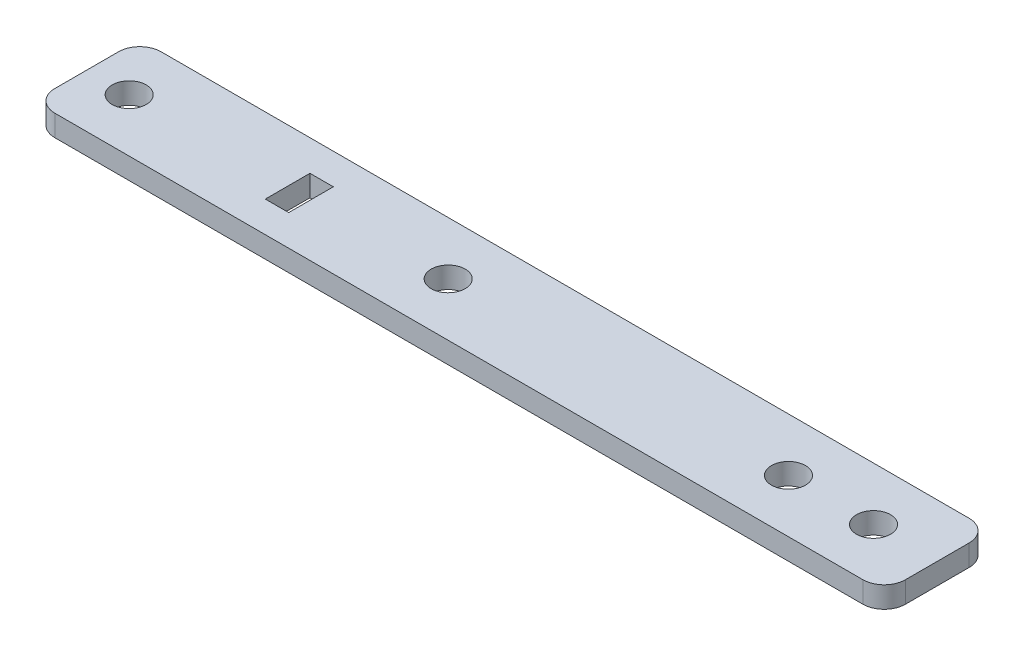
ISO-10303-21;
HEADER;
FILE_DESCRIPTION(('STEP AP214'),'2;1');
FILE_NAME('part.step','',(''),(''),'','','');
FILE_SCHEMA(('AUTOMOTIVE_DESIGN { 1 0 10303 214 1 1 1 1 }'));
ENDSEC;
DATA;
#1=APPLICATION_CONTEXT('core data for automotive mechanical design processes');
#2=APPLICATION_PROTOCOL_DEFINITION('international standard','automotive_design',2000,#1);
#3=PRODUCT_CONTEXT('',#1,'mechanical');
#4=PRODUCT('Part','Part','',(#3));
#5=PRODUCT_RELATED_PRODUCT_CATEGORY('part','',(#4));
#6=PRODUCT_DEFINITION_FORMATION('','',#4);
#7=PRODUCT_DEFINITION_CONTEXT('part definition',#1,'design');
#8=PRODUCT_DEFINITION('design','',#6,#7);
#9=PRODUCT_DEFINITION_SHAPE('','',#8);
#10=(LENGTH_UNIT() NAMED_UNIT(*) SI_UNIT(.MILLI.,.METRE.));
#11=(NAMED_UNIT(*) PLANE_ANGLE_UNIT() SI_UNIT($,.RADIAN.));
#12=(NAMED_UNIT(*) SI_UNIT($,.STERADIAN.) SOLID_ANGLE_UNIT());
#13=UNCERTAINTY_MEASURE_WITH_UNIT(LENGTH_MEASURE(1.E-05),#10,'distance_accuracy_value','');
#14=(GEOMETRIC_REPRESENTATION_CONTEXT(3) GLOBAL_UNCERTAINTY_ASSIGNED_CONTEXT((#13)) GLOBAL_UNIT_ASSIGNED_CONTEXT((#10,
#11,#12)) REPRESENTATION_CONTEXT('',''));
#15=CARTESIAN_POINT('',(0.,0.,0.));
#16=DIRECTION('',(0.,0.,1.));
#17=DIRECTION('',(1.,0.,0.));
#18=AXIS2_PLACEMENT_3D('',#15,#16,#17);
#19=CARTESIAN_POINT('',(400.,-55.,-25.));
#20=DIRECTION('',(0.,-1.,0.));
#21=DIRECTION('',(0.,0.,-1.));
#22=AXIS2_PLACEMENT_3D('',#19,#20,#21);
#23=PLANE('',#22);
#24=CARTESIAN_POINT('',(330.,-55.,0.));
#25=DIRECTION('',(0.,1.,0.));
#26=DIRECTION('',(0.,0.,1.));
#27=AXIS2_PLACEMENT_3D('',#24,#25,#26);
#28=CIRCLE('',#27,8.00000000000001);
#29=CARTESIAN_POINT('',(330.,-55.,8.00000000000001));
#30=VERTEX_POINT('',#29);
#31=EDGE_CURVE('E442',#30,#30,#28,.T.);
#32=ORIENTED_EDGE('',*,*,#31,.F.);
#33=EDGE_LOOP('',(#32));
#34=FACE_BOUND('',#33,.T.);
#35=DIRECTION('',(1.,0.,0.));
#36=VECTOR('',#35,1.);
#37=CARTESIAN_POINT('',(94.5,-55.,10.5));
#38=LINE('',#37,#36);
#39=CARTESIAN_POINT('',(94.5,-55.,10.5));
#40=VERTEX_POINT('',#39);
#41=CARTESIAN_POINT('',(105.5,-55.,10.5));
#42=VERTEX_POINT('',#41);
#43=EDGE_CURVE('E428',#40,#42,#38,.T.);
#44=ORIENTED_EDGE('',*,*,#43,.F.);
#45=DIRECTION('',(0.,0.,1.));
#46=VECTOR('',#45,1.);
#47=CARTESIAN_POINT('',(94.5,-55.,10.5));
#48=LINE('',#47,#46);
#49=CARTESIAN_POINT('',(94.5,-55.,-10.5));
#50=VERTEX_POINT('',#49);
#51=EDGE_CURVE('E164',#50,#40,#48,.T.);
#52=ORIENTED_EDGE('',*,*,#51,.F.);
#53=DIRECTION('',(-1.,0.,0.));
#54=VECTOR('',#53,1.);
#55=CARTESIAN_POINT('',(94.5,-55.,-10.5));
#56=LINE('',#55,#54);
#57=CARTESIAN_POINT('',(105.5,-55.,-10.5));
#58=VERTEX_POINT('',#57);
#59=EDGE_CURVE('E161',#58,#50,#56,.T.);
#60=ORIENTED_EDGE('',*,*,#59,.F.);
#61=DIRECTION('',(0.,0.,-1.));
#62=VECTOR('',#61,1.);
#63=CARTESIAN_POINT('',(105.5,-55.,10.5));
#64=LINE('',#63,#62);
#65=EDGE_CURVE('E135',#42,#58,#64,.T.);
#66=ORIENTED_EDGE('',*,*,#65,.F.);
#67=EDGE_LOOP('',(#44,#52,#60,#66));
#68=FACE_BOUND('',#67,.T.);
#69=DIRECTION('',(-1.,0.,0.));
#70=VECTOR('',#69,1.);
#71=CARTESIAN_POINT('',(400.,-55.,-25.));
#72=LINE('',#71,#70);
#73=CARTESIAN_POINT('',(390.,-55.,-25.));
#74=VERTEX_POINT('',#73);
#75=CARTESIAN_POINT('',(10.,-55.,-25.));
#76=VERTEX_POINT('',#75);
#77=EDGE_CURVE('E184',#74,#76,#72,.T.);
#78=ORIENTED_EDGE('',*,*,#77,.T.);
#79=CARTESIAN_POINT('',(10.,-55.,-15.));
#80=DIRECTION('',(0.,-1.,0.));
#81=DIRECTION('',(0.,0.,-1.));
#82=AXIS2_PLACEMENT_3D('',#79,#80,#81);
#83=CIRCLE('',#82,10.);
#84=CARTESIAN_POINT('',(0.,-55.,-15.));
#85=VERTEX_POINT('',#84);
#86=EDGE_CURVE('E198',#76,#85,#83,.F.);
#87=ORIENTED_EDGE('',*,*,#86,.T.);
#88=DIRECTION('',(0.,0.,1.));
#89=VECTOR('',#88,1.);
#90=CARTESIAN_POINT('',(0.,-55.,-25.));
#91=LINE('',#90,#89);
#92=CARTESIAN_POINT('',(0.,-55.,15.));
#93=VERTEX_POINT('',#92);
#94=EDGE_CURVE('E163',#85,#93,#91,.T.);
#95=ORIENTED_EDGE('',*,*,#94,.T.);
#96=CARTESIAN_POINT('',(10.,-55.,15.));
#97=DIRECTION('',(0.,-1.,0.));
#98=DIRECTION('',(0.,0.,-1.));
#99=AXIS2_PLACEMENT_3D('',#96,#97,#98);
#100=CIRCLE('',#99,10.);
#101=CARTESIAN_POINT('',(10.,-55.,25.));
#102=VERTEX_POINT('',#101);
#103=EDGE_CURVE('E196',#93,#102,#100,.F.);
#104=ORIENTED_EDGE('',*,*,#103,.T.);
#105=DIRECTION('',(-1.,0.,0.));
#106=VECTOR('',#105,1.);
#107=CARTESIAN_POINT('',(400.,-55.,25.));
#108=LINE('',#107,#106);
#109=CARTESIAN_POINT('',(390.,-55.,25.));
#110=VERTEX_POINT('',#109);
#111=EDGE_CURVE('E181',#110,#102,#108,.T.);
#112=ORIENTED_EDGE('',*,*,#111,.F.);
#113=CARTESIAN_POINT('',(390.,-55.,15.));
#114=DIRECTION('',(0.,-1.,0.));
#115=DIRECTION('',(0.,0.,-1.));
#116=AXIS2_PLACEMENT_3D('',#113,#114,#115);
#117=CIRCLE('',#116,10.);
#118=CARTESIAN_POINT('',(400.,-55.,15.));
#119=VERTEX_POINT('',#118);
#120=EDGE_CURVE('E192',#110,#119,#117,.F.);
#121=ORIENTED_EDGE('',*,*,#120,.T.);
#122=DIRECTION('',(0.,0.,1.));
#123=VECTOR('',#122,1.);
#124=CARTESIAN_POINT('',(400.,-55.,-25.));
#125=LINE('',#124,#123);
#126=CARTESIAN_POINT('',(400.,-55.,-15.));
#127=VERTEX_POINT('',#126);
#128=EDGE_CURVE('E165',#127,#119,#125,.T.);
#129=ORIENTED_EDGE('',*,*,#128,.F.);
#130=CARTESIAN_POINT('',(390.,-55.,-15.));
#131=DIRECTION('',(0.,-1.,0.));
#132=DIRECTION('',(0.,0.,-1.));
#133=AXIS2_PLACEMENT_3D('',#130,#131,#132);
#134=CIRCLE('',#133,10.);
#135=EDGE_CURVE('E194',#127,#74,#134,.F.);
#136=ORIENTED_EDGE('',*,*,#135,.T.);
#137=EDGE_LOOP('',(#78,#87,#95,#104,#112,#121,#129,#136));
#138=FACE_BOUND('',#137,.T.);
#139=CARTESIAN_POINT('',(20.,-55.,0.));
#140=DIRECTION('',(0.,1.,0.));
#141=DIRECTION('',(0.,0.,1.));
#142=AXIS2_PLACEMENT_3D('',#139,#140,#141);
#143=CIRCLE('',#142,8.);
#144=CARTESIAN_POINT('',(20.,-55.,8.));
#145=VERTEX_POINT('',#144);
#146=EDGE_CURVE('E421',#145,#145,#143,.T.);
#147=ORIENTED_EDGE('',*,*,#146,.F.);
#148=EDGE_LOOP('',(#147));
#149=FACE_BOUND('',#148,.T.);
#150=CARTESIAN_POINT('',(370.,-55.,0.));
#151=DIRECTION('',(0.,1.,0.));
#152=DIRECTION('',(0.,0.,1.));
#153=AXIS2_PLACEMENT_3D('',#150,#151,#152);
#154=CIRCLE('',#153,8.00000000000001);
#155=CARTESIAN_POINT('',(370.,-55.,8.00000000000001));
#156=VERTEX_POINT('',#155);
#157=EDGE_CURVE('E435',#156,#156,#154,.T.);
#158=ORIENTED_EDGE('',*,*,#157,.F.);
#159=EDGE_LOOP('',(#158));
#160=FACE_BOUND('',#159,.T.);
#161=CARTESIAN_POINT('',(170.,-55.,0.));
#162=DIRECTION('',(0.,1.,0.));
#163=DIRECTION('',(0.,0.,1.));
#164=AXIS2_PLACEMENT_3D('',#161,#162,#163);
#165=CIRCLE('',#164,8.00000000000001);
#166=CARTESIAN_POINT('',(170.,-55.,8.00000000000001));
#167=VERTEX_POINT('',#166);
#168=EDGE_CURVE('E439',#167,#167,#165,.T.);
#169=ORIENTED_EDGE('',*,*,#168,.F.);
#170=EDGE_LOOP('',(#169));
#171=FACE_BOUND('',#170,.T.);
#172=ADVANCED_FACE('F36',(#34,#68,#138,#149,#160,#171),#23,.F.);
#173=CARTESIAN_POINT('',(400.,-55.,-25.));
#174=DIRECTION('',(0.,0.,1.));
#175=DIRECTION('',(1.,0.,0.));
#176=AXIS2_PLACEMENT_3D('',#173,#174,#175);
#177=PLANE('',#176);
#178=DIRECTION('',(-1.,0.,0.));
#179=VECTOR('',#178,1.);
#180=CARTESIAN_POINT('',(400.,-65.,-25.));
#181=LINE('',#180,#179);
#182=CARTESIAN_POINT('',(390.,-65.,-25.));
#183=VERTEX_POINT('',#182);
#184=CARTESIAN_POINT('',(10.,-65.,-25.));
#185=VERTEX_POINT('',#184);
#186=EDGE_CURVE('E172',#183,#185,#181,.T.);
#187=ORIENTED_EDGE('',*,*,#186,.T.);
#188=DIRECTION('',(0.,1.,0.));
#189=VECTOR('',#188,1.);
#190=CARTESIAN_POINT('',(10.,-55.,-25.));
#191=LINE('',#190,#189);
#192=EDGE_CURVE('E189',#185,#76,#191,.T.);
#193=ORIENTED_EDGE('',*,*,#192,.T.);
#194=ORIENTED_EDGE('',*,*,#77,.F.);
#195=DIRECTION('',(0.,1.,0.));
#196=VECTOR('',#195,1.);
#197=CARTESIAN_POINT('',(390.,-55.,-25.));
#198=LINE('',#197,#196);
#199=EDGE_CURVE('E187',#74,#183,#198,.F.);
#200=ORIENTED_EDGE('',*,*,#199,.T.);
#201=EDGE_LOOP('',(#187,#193,#194,#200));
#202=FACE_BOUND('',#201,.T.);
#203=ADVANCED_FACE('F245',(#202),#177,.F.);
#204=CARTESIAN_POINT('',(400.,-65.,25.));
#205=DIRECTION('',(0.,0.,-1.));
#206=DIRECTION('',(-1.,0.,0.));
#207=AXIS2_PLACEMENT_3D('',#204,#205,#206);
#208=PLANE('',#207);
#209=ORIENTED_EDGE('',*,*,#111,.T.);
#210=DIRECTION('',(0.,-1.,0.));
#211=VECTOR('',#210,1.);
#212=CARTESIAN_POINT('',(10.,-65.,25.));
#213=LINE('',#212,#211);
#214=CARTESIAN_POINT('',(10.,-65.,25.));
#215=VERTEX_POINT('',#214);
#216=EDGE_CURVE('E212',#102,#215,#213,.T.);
#217=ORIENTED_EDGE('',*,*,#216,.T.);
#218=DIRECTION('',(-1.,0.,0.));
#219=VECTOR('',#218,1.);
#220=CARTESIAN_POINT('',(400.,-65.,25.));
#221=LINE('',#220,#219);
#222=CARTESIAN_POINT('',(390.,-65.,25.));
#223=VERTEX_POINT('',#222);
#224=EDGE_CURVE('E179',#223,#215,#221,.T.);
#225=ORIENTED_EDGE('',*,*,#224,.F.);
#226=DIRECTION('',(0.,-1.,0.));
#227=VECTOR('',#226,1.);
#228=CARTESIAN_POINT('',(390.,-65.,25.));
#229=LINE('',#228,#227);
#230=EDGE_CURVE('E210',#223,#110,#229,.F.);
#231=ORIENTED_EDGE('',*,*,#230,.T.);
#232=EDGE_LOOP('',(#209,#217,#225,#231));
#233=FACE_BOUND('',#232,.T.);
#234=ADVANCED_FACE('F232',(#233),#208,.F.);
#235=CARTESIAN_POINT('',(400.,-65.,-25.));
#236=DIRECTION('',(0.,1.,0.));
#237=DIRECTION('',(0.,0.,1.));
#238=AXIS2_PLACEMENT_3D('',#235,#236,#237);
#239=PLANE('',#238);
#240=CARTESIAN_POINT('',(330.,-65.,0.));
#241=DIRECTION('',(0.,1.,0.));
#242=DIRECTION('',(0.,0.,1.));
#243=AXIS2_PLACEMENT_3D('',#240,#241,#242);
#244=CIRCLE('',#243,8.00000000000001);
#245=CARTESIAN_POINT('',(330.,-65.,8.00000000000001));
#246=VERTEX_POINT('',#245);
#247=EDGE_CURVE('E409',#246,#246,#244,.T.);
#248=ORIENTED_EDGE('',*,*,#247,.T.);
#249=EDGE_LOOP('',(#248));
#250=FACE_BOUND('',#249,.T.);
#251=CARTESIAN_POINT('',(170.,-65.,0.));
#252=DIRECTION('',(0.,1.,0.));
#253=DIRECTION('',(0.,0.,1.));
#254=AXIS2_PLACEMENT_3D('',#251,#252,#253);
#255=CIRCLE('',#254,8.00000000000001);
#256=CARTESIAN_POINT('',(170.,-65.,8.00000000000001));
#257=VERTEX_POINT('',#256);
#258=EDGE_CURVE('E413',#257,#257,#255,.T.);
#259=ORIENTED_EDGE('',*,*,#258,.T.);
#260=EDGE_LOOP('',(#259));
#261=FACE_BOUND('',#260,.T.);
#262=CARTESIAN_POINT('',(370.,-65.,0.));
#263=DIRECTION('',(0.,1.,0.));
#264=DIRECTION('',(0.,0.,1.));
#265=AXIS2_PLACEMENT_3D('',#262,#263,#264);
#266=CIRCLE('',#265,8.00000000000001);
#267=CARTESIAN_POINT('',(370.,-65.,8.00000000000001));
#268=VERTEX_POINT('',#267);
#269=EDGE_CURVE('E417',#268,#268,#266,.T.);
#270=ORIENTED_EDGE('',*,*,#269,.T.);
#271=EDGE_LOOP('',(#270));
#272=FACE_BOUND('',#271,.T.);
#273=CARTESIAN_POINT('',(20.,-65.,0.));
#274=DIRECTION('',(0.,1.,0.));
#275=DIRECTION('',(0.,0.,1.));
#276=AXIS2_PLACEMENT_3D('',#273,#274,#275);
#277=CIRCLE('',#276,8.);
#278=CARTESIAN_POINT('',(20.,-65.,8.));
#279=VERTEX_POINT('',#278);
#280=EDGE_CURVE('E420',#279,#279,#277,.T.);
#281=ORIENTED_EDGE('',*,*,#280,.T.);
#282=EDGE_LOOP('',(#281));
#283=FACE_BOUND('',#282,.T.);
#284=DIRECTION('',(1.,0.,0.));
#285=VECTOR('',#284,1.);
#286=CARTESIAN_POINT('',(94.5,-65.,-10.5));
#287=LINE('',#286,#285);
#288=CARTESIAN_POINT('',(94.5,-65.,-10.5));
#289=VERTEX_POINT('',#288);
#290=CARTESIAN_POINT('',(105.5,-65.,-10.5));
#291=VERTEX_POINT('',#290);
#292=EDGE_CURVE('E143',#289,#291,#287,.T.);
#293=ORIENTED_EDGE('',*,*,#292,.F.);
#294=DIRECTION('',(0.,0.,-1.));
#295=VECTOR('',#294,1.);
#296=CARTESIAN_POINT('',(94.5,-65.,10.5));
#297=LINE('',#296,#295);
#298=CARTESIAN_POINT('',(94.5,-65.,10.5));
#299=VERTEX_POINT('',#298);
#300=EDGE_CURVE('E148',#299,#289,#297,.T.);
#301=ORIENTED_EDGE('',*,*,#300,.F.);
#302=DIRECTION('',(-1.,0.,0.));
#303=VECTOR('',#302,1.);
#304=CARTESIAN_POINT('',(94.5,-65.,10.5));
#305=LINE('',#304,#303);
#306=CARTESIAN_POINT('',(105.5,-65.,10.5));
#307=VERTEX_POINT('',#306);
#308=EDGE_CURVE('E152',#307,#299,#305,.T.);
#309=ORIENTED_EDGE('',*,*,#308,.F.);
#310=DIRECTION('',(0.,0.,1.));
#311=VECTOR('',#310,1.);
#312=CARTESIAN_POINT('',(105.5,-65.,10.5));
#313=LINE('',#312,#311);
#314=EDGE_CURVE('E132',#291,#307,#313,.T.);
#315=ORIENTED_EDGE('',*,*,#314,.F.);
#316=EDGE_LOOP('',(#293,#301,#309,#315));
#317=FACE_BOUND('',#316,.T.);
#318=DIRECTION('',(0.,0.,-1.));
#319=VECTOR('',#318,1.);
#320=CARTESIAN_POINT('',(0.,-65.,-25.));
#321=LINE('',#320,#319);
#322=CARTESIAN_POINT('',(0.,-65.,15.));
#323=VERTEX_POINT('',#322);
#324=CARTESIAN_POINT('',(0.,-65.,-15.));
#325=VERTEX_POINT('',#324);
#326=EDGE_CURVE('E169',#323,#325,#321,.T.);
#327=ORIENTED_EDGE('',*,*,#326,.T.);
#328=CARTESIAN_POINT('',(10.,-65.,-15.));
#329=DIRECTION('',(0.,1.,0.));
#330=DIRECTION('',(0.,0.,1.));
#331=AXIS2_PLACEMENT_3D('',#328,#329,#330);
#332=CIRCLE('',#331,10.);
#333=EDGE_CURVE('E208',#325,#185,#332,.F.);
#334=ORIENTED_EDGE('',*,*,#333,.T.);
#335=ORIENTED_EDGE('',*,*,#186,.F.);
#336=CARTESIAN_POINT('',(390.,-65.,-15.));
#337=DIRECTION('',(0.,1.,0.));
#338=DIRECTION('',(0.,0.,1.));
#339=AXIS2_PLACEMENT_3D('',#336,#337,#338);
#340=CIRCLE('',#339,10.);
#341=CARTESIAN_POINT('',(400.,-65.,-15.));
#342=VERTEX_POINT('',#341);
#343=EDGE_CURVE('E205',#183,#342,#340,.F.);
#344=ORIENTED_EDGE('',*,*,#343,.T.);
#345=DIRECTION('',(0.,0.,-1.));
#346=VECTOR('',#345,1.);
#347=CARTESIAN_POINT('',(400.,-65.,-25.));
#348=LINE('',#347,#346);
#349=CARTESIAN_POINT('',(400.,-65.,15.));
#350=VERTEX_POINT('',#349);
#351=EDGE_CURVE('E168',#350,#342,#348,.T.);
#352=ORIENTED_EDGE('',*,*,#351,.F.);
#353=CARTESIAN_POINT('',(390.,-65.,15.));
#354=DIRECTION('',(0.,1.,0.));
#355=DIRECTION('',(0.,0.,1.));
#356=AXIS2_PLACEMENT_3D('',#353,#354,#355);
#357=CIRCLE('',#356,10.);
#358=EDGE_CURVE('E59',#350,#223,#357,.F.);
#359=ORIENTED_EDGE('',*,*,#358,.T.);
#360=ORIENTED_EDGE('',*,*,#224,.T.);
#361=CARTESIAN_POINT('',(10.,-65.,15.));
#362=DIRECTION('',(0.,1.,0.));
#363=DIRECTION('',(0.,0.,1.));
#364=AXIS2_PLACEMENT_3D('',#361,#362,#363);
#365=CIRCLE('',#364,10.);
#366=EDGE_CURVE('E51',#215,#323,#365,.F.);
#367=ORIENTED_EDGE('',*,*,#366,.T.);
#368=EDGE_LOOP('',(#327,#334,#335,#344,#352,#359,#360,#367));
#369=FACE_BOUND('',#368,.T.);
#370=ADVANCED_FACE('F150',(#250,#261,#272,#283,#317,#369),#239,.F.);
#371=CARTESIAN_POINT('',(400.,-5.,0.));
#372=DIRECTION('',(-1.,0.,0.));
#373=DIRECTION('',(0.,0.,1.));
#374=AXIS2_PLACEMENT_3D('',#371,#372,#373);
#375=PLANE('',#374);
#376=ORIENTED_EDGE('',*,*,#351,.T.);
#377=DIRECTION('',(0.,1.,0.));
#378=VECTOR('',#377,1.);
#379=CARTESIAN_POINT('',(400.,-5.,-15.));
#380=LINE('',#379,#378);
#381=EDGE_CURVE('E11',#342,#127,#380,.T.);
#382=ORIENTED_EDGE('',*,*,#381,.T.);
#383=ORIENTED_EDGE('',*,*,#128,.T.);
#384=DIRECTION('',(0.,-1.,0.));
#385=VECTOR('',#384,1.);
#386=CARTESIAN_POINT('',(400.,-5.,15.));
#387=LINE('',#386,#385);
#388=EDGE_CURVE('E44',#119,#350,#387,.T.);
#389=ORIENTED_EDGE('',*,*,#388,.T.);
#390=EDGE_LOOP('',(#376,#382,#383,#389));
#391=FACE_BOUND('',#390,.T.);
#392=ADVANCED_FACE('F216',(#391),#375,.F.);
#393=CARTESIAN_POINT('',(0.,-5.,0.));
#394=DIRECTION('',(-1.,0.,0.));
#395=DIRECTION('',(0.,0.,1.));
#396=AXIS2_PLACEMENT_3D('',#393,#394,#395);
#397=PLANE('',#396);
#398=ORIENTED_EDGE('',*,*,#94,.F.);
#399=DIRECTION('',(0.,1.,0.));
#400=VECTOR('',#399,1.);
#401=CARTESIAN_POINT('',(0.,-65.,-15.));
#402=LINE('',#401,#400);
#403=EDGE_CURVE('E202',#85,#325,#402,.F.);
#404=ORIENTED_EDGE('',*,*,#403,.T.);
#405=ORIENTED_EDGE('',*,*,#326,.F.);
#406=DIRECTION('',(0.,-1.,0.));
#407=VECTOR('',#406,1.);
#408=CARTESIAN_POINT('',(0.,-55.,15.));
#409=LINE('',#408,#407);
#410=EDGE_CURVE('E200',#323,#93,#409,.F.);
#411=ORIENTED_EDGE('',*,*,#410,.T.);
#412=EDGE_LOOP('',(#398,#404,#405,#411));
#413=FACE_BOUND('',#412,.T.);
#414=ADVANCED_FACE('F237',(#413),#397,.T.);
#415=CARTESIAN_POINT('',(94.5,-31.2934608177406,10.5));
#416=DIRECTION('',(-1.,0.,0.));
#417=DIRECTION('',(0.,0.,1.));
#418=AXIS2_PLACEMENT_3D('',#415,#416,#417);
#419=PLANE('',#418);
#420=ORIENTED_EDGE('',*,*,#51,.T.);
#421=DIRECTION('',(0.,-1.,0.));
#422=VECTOR('',#421,1.);
#423=CARTESIAN_POINT('',(94.5,-31.2934608177406,10.5));
#424=LINE('',#423,#422);
#425=EDGE_CURVE('E157',#40,#299,#424,.T.);
#426=ORIENTED_EDGE('',*,*,#425,.T.);
#427=ORIENTED_EDGE('',*,*,#300,.T.);
#428=DIRECTION('',(0.,-1.,0.));
#429=VECTOR('',#428,1.);
#430=CARTESIAN_POINT('',(94.5,-31.2934608177406,-10.5));
#431=LINE('',#430,#429);
#432=EDGE_CURVE('E139',#50,#289,#431,.T.);
#433=ORIENTED_EDGE('',*,*,#432,.F.);
#434=EDGE_LOOP('',(#420,#426,#427,#433));
#435=FACE_BOUND('',#434,.T.);
#436=ADVANCED_FACE('F353',(#435),#419,.F.);
#437=CARTESIAN_POINT('',(94.5,-31.2934608177406,10.5));
#438=DIRECTION('',(0.,0.,1.));
#439=DIRECTION('',(1.,0.,0.));
#440=AXIS2_PLACEMENT_3D('',#437,#438,#439);
#441=PLANE('',#440);
#442=ORIENTED_EDGE('',*,*,#43,.T.);
#443=DIRECTION('',(0.,-1.,0.));
#444=VECTOR('',#443,1.);
#445=CARTESIAN_POINT('',(105.5,-31.2934608177406,10.5));
#446=LINE('',#445,#444);
#447=EDGE_CURVE('E138',#42,#307,#446,.T.);
#448=ORIENTED_EDGE('',*,*,#447,.T.);
#449=ORIENTED_EDGE('',*,*,#308,.T.);
#450=ORIENTED_EDGE('',*,*,#425,.F.);
#451=EDGE_LOOP('',(#442,#448,#449,#450));
#452=FACE_BOUND('',#451,.T.);
#453=ADVANCED_FACE('F344',(#452),#441,.F.);
#454=CARTESIAN_POINT('',(105.5,-31.2934608177406,10.5));
#455=DIRECTION('',(1.,0.,0.));
#456=DIRECTION('',(0.,0.,-1.));
#457=AXIS2_PLACEMENT_3D('',#454,#455,#456);
#458=PLANE('',#457);
#459=ORIENTED_EDGE('',*,*,#65,.T.);
#460=DIRECTION('',(0.,-1.,0.));
#461=VECTOR('',#460,1.);
#462=CARTESIAN_POINT('',(105.5,-31.2934608177406,-10.5));
#463=LINE('',#462,#461);
#464=EDGE_CURVE('E127',#58,#291,#463,.T.);
#465=ORIENTED_EDGE('',*,*,#464,.T.);
#466=ORIENTED_EDGE('',*,*,#314,.T.);
#467=ORIENTED_EDGE('',*,*,#447,.F.);
#468=EDGE_LOOP('',(#459,#465,#466,#467));
#469=FACE_BOUND('',#468,.T.);
#470=ADVANCED_FACE('F129',(#469),#458,.F.);
#471=CARTESIAN_POINT('',(94.5,-31.2934608177406,-10.5));
#472=DIRECTION('',(0.,0.,-1.));
#473=DIRECTION('',(-1.,0.,0.));
#474=AXIS2_PLACEMENT_3D('',#471,#472,#473);
#475=PLANE('',#474);
#476=ORIENTED_EDGE('',*,*,#59,.T.);
#477=ORIENTED_EDGE('',*,*,#432,.T.);
#478=ORIENTED_EDGE('',*,*,#292,.T.);
#479=ORIENTED_EDGE('',*,*,#464,.F.);
#480=EDGE_LOOP('',(#476,#477,#478,#479));
#481=FACE_BOUND('',#480,.T.);
#482=ADVANCED_FACE('F144',(#481),#475,.F.);
#483=CARTESIAN_POINT('',(20.,-55.,0.));
#484=DIRECTION('',(0.,1.,0.));
#485=DIRECTION('',(0.,0.,1.));
#486=AXIS2_PLACEMENT_3D('',#483,#484,#485);
#487=CYLINDRICAL_SURFACE('',#486,8.);
#488=ORIENTED_EDGE('',*,*,#280,.F.);
#489=EDGE_LOOP('',(#488));
#490=FACE_BOUND('',#489,.T.);
#491=ORIENTED_EDGE('',*,*,#146,.T.);
#492=EDGE_LOOP('',(#491));
#493=FACE_BOUND('',#492,.T.);
#494=ADVANCED_FACE('F315',(#490,#493),#487,.F.);
#495=CARTESIAN_POINT('',(370.,-55.,0.));
#496=DIRECTION('',(0.,1.,0.));
#497=DIRECTION('',(0.,0.,1.));
#498=AXIS2_PLACEMENT_3D('',#495,#496,#497);
#499=CYLINDRICAL_SURFACE('',#498,8.00000000000001);
#500=ORIENTED_EDGE('',*,*,#269,.F.);
#501=EDGE_LOOP('',(#500));
#502=FACE_BOUND('',#501,.T.);
#503=ORIENTED_EDGE('',*,*,#157,.T.);
#504=EDGE_LOOP('',(#503));
#505=FACE_BOUND('',#504,.T.);
#506=ADVANCED_FACE('F305',(#502,#505),#499,.F.);
#507=CARTESIAN_POINT('',(170.,-55.,0.));
#508=DIRECTION('',(0.,1.,0.));
#509=DIRECTION('',(0.,0.,1.));
#510=AXIS2_PLACEMENT_3D('',#507,#508,#509);
#511=CYLINDRICAL_SURFACE('',#510,8.00000000000001);
#512=ORIENTED_EDGE('',*,*,#258,.F.);
#513=EDGE_LOOP('',(#512));
#514=FACE_BOUND('',#513,.T.);
#515=ORIENTED_EDGE('',*,*,#168,.T.);
#516=EDGE_LOOP('',(#515));
#517=FACE_BOUND('',#516,.T.);
#518=ADVANCED_FACE('F294',(#514,#517),#511,.F.);
#519=CARTESIAN_POINT('',(330.,-55.,0.));
#520=DIRECTION('',(0.,1.,0.));
#521=DIRECTION('',(0.,0.,1.));
#522=AXIS2_PLACEMENT_3D('',#519,#520,#521);
#523=CYLINDRICAL_SURFACE('',#522,8.00000000000001);
#524=ORIENTED_EDGE('',*,*,#247,.F.);
#525=EDGE_LOOP('',(#524));
#526=FACE_BOUND('',#525,.T.);
#527=ORIENTED_EDGE('',*,*,#31,.T.);
#528=EDGE_LOOP('',(#527));
#529=FACE_BOUND('',#528,.T.);
#530=ADVANCED_FACE('F258',(#526,#529),#523,.F.);
#531=CARTESIAN_POINT('',(10.,-55.,-15.));
#532=DIRECTION('',(0.,-1.,0.));
#533=DIRECTION('',(0.,0.,-1.));
#534=AXIS2_PLACEMENT_3D('',#531,#532,#533);
#535=CYLINDRICAL_SURFACE('',#534,10.);
#536=ORIENTED_EDGE('',*,*,#333,.F.);
#537=ORIENTED_EDGE('',*,*,#403,.F.);
#538=ORIENTED_EDGE('',*,*,#86,.F.);
#539=ORIENTED_EDGE('',*,*,#192,.F.);
#540=EDGE_LOOP('',(#536,#537,#538,#539));
#541=FACE_BOUND('',#540,.T.);
#542=ADVANCED_FACE('F242',(#541),#535,.T.);
#543=CARTESIAN_POINT('',(10.,-65.,15.));
#544=DIRECTION('',(0.,1.,0.));
#545=DIRECTION('',(0.,0.,1.));
#546=AXIS2_PLACEMENT_3D('',#543,#544,#545);
#547=CYLINDRICAL_SURFACE('',#546,10.);
#548=ORIENTED_EDGE('',*,*,#103,.F.);
#549=ORIENTED_EDGE('',*,*,#410,.F.);
#550=ORIENTED_EDGE('',*,*,#366,.F.);
#551=ORIENTED_EDGE('',*,*,#216,.F.);
#552=EDGE_LOOP('',(#548,#549,#550,#551));
#553=FACE_BOUND('',#552,.T.);
#554=ADVANCED_FACE('F240',(#553),#547,.T.);
#555=CARTESIAN_POINT('',(390.,-5.,-15.));
#556=DIRECTION('',(0.,1.,0.));
#557=DIRECTION('',(0.,0.,1.));
#558=AXIS2_PLACEMENT_3D('',#555,#556,#557);
#559=CYLINDRICAL_SURFACE('',#558,10.);
#560=ORIENTED_EDGE('',*,*,#343,.F.);
#561=ORIENTED_EDGE('',*,*,#199,.F.);
#562=ORIENTED_EDGE('',*,*,#135,.F.);
#563=ORIENTED_EDGE('',*,*,#381,.F.);
#564=EDGE_LOOP('',(#560,#561,#562,#563));
#565=FACE_BOUND('',#564,.T.);
#566=ADVANCED_FACE('F225',(#565),#559,.T.);
#567=CARTESIAN_POINT('',(390.,-5.,15.));
#568=DIRECTION('',(0.,-1.,0.));
#569=DIRECTION('',(0.,0.,-1.));
#570=AXIS2_PLACEMENT_3D('',#567,#568,#569);
#571=CYLINDRICAL_SURFACE('',#570,10.);
#572=ORIENTED_EDGE('',*,*,#120,.F.);
#573=ORIENTED_EDGE('',*,*,#230,.F.);
#574=ORIENTED_EDGE('',*,*,#358,.F.);
#575=ORIENTED_EDGE('',*,*,#388,.F.);
#576=EDGE_LOOP('',(#572,#573,#574,#575));
#577=FACE_BOUND('',#576,.T.);
#578=ADVANCED_FACE('F38',(#577),#571,.T.);
#579=CLOSED_SHELL('',(#172,#203,#234,#370,#392,#414,#436,#453,#470,#482,#494,#506,#518,#530,
#542,#554,#566,#578));
#580=MANIFOLD_SOLID_BREP('B2',#579);
#581=ADVANCED_BREP_SHAPE_REPRESENTATION('',(#18,#580),#14);
#582=SHAPE_DEFINITION_REPRESENTATION(#9,#581);
ENDSEC;
END-ISO-10303-21;
